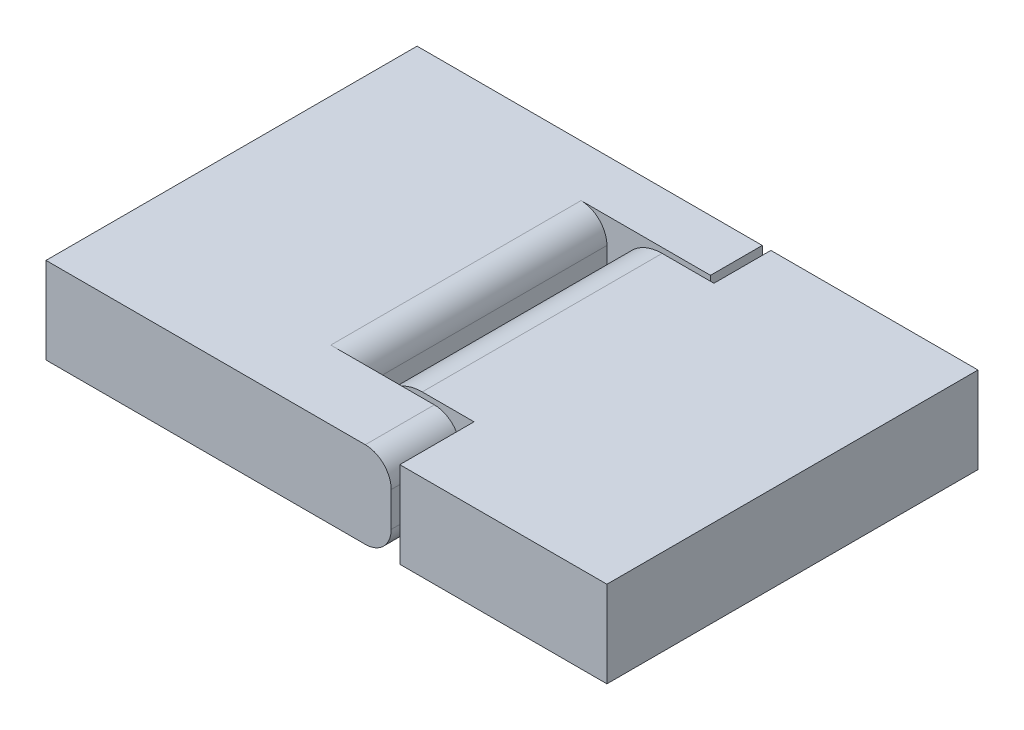
ISO-10303-21;
HEADER;
FILE_DESCRIPTION(('STEP AP214'),'2;1');
FILE_NAME('part.step','',(''),(''),'','','');
FILE_SCHEMA(('AUTOMOTIVE_DESIGN { 1 0 10303 214 1 1 1 1 }'));
ENDSEC;
DATA;
#1=APPLICATION_CONTEXT('core data for automotive mechanical design processes');
#2=APPLICATION_PROTOCOL_DEFINITION('international standard','automotive_design',2000,#1);
#3=PRODUCT_CONTEXT('',#1,'mechanical');
#4=PRODUCT('Part','Part','',(#3));
#5=PRODUCT_RELATED_PRODUCT_CATEGORY('part','',(#4));
#6=PRODUCT_DEFINITION_FORMATION('','',#4);
#7=PRODUCT_DEFINITION_CONTEXT('part definition',#1,'design');
#8=PRODUCT_DEFINITION('design','',#6,#7);
#9=PRODUCT_DEFINITION_SHAPE('','',#8);
#10=(LENGTH_UNIT() NAMED_UNIT(*) SI_UNIT(.MILLI.,.METRE.));
#11=(NAMED_UNIT(*) PLANE_ANGLE_UNIT() SI_UNIT($,.RADIAN.));
#12=(NAMED_UNIT(*) SI_UNIT($,.STERADIAN.) SOLID_ANGLE_UNIT());
#13=UNCERTAINTY_MEASURE_WITH_UNIT(LENGTH_MEASURE(1.E-05),#10,'distance_accuracy_value','');
#14=(GEOMETRIC_REPRESENTATION_CONTEXT(3) GLOBAL_UNCERTAINTY_ASSIGNED_CONTEXT((#13)) GLOBAL_UNIT_ASSIGNED_CONTEXT((#10,
#11,#12)) REPRESENTATION_CONTEXT('',''));
#15=CARTESIAN_POINT('',(0.,0.,0.));
#16=DIRECTION('',(0.,0.,1.));
#17=DIRECTION('',(1.,0.,0.));
#18=AXIS2_PLACEMENT_3D('',#15,#16,#17);
#19=CARTESIAN_POINT('',(14.,-67.5,3.));
#20=DIRECTION('',(-1.,0.,0.));
#21=DIRECTION('',(0.,0.,1.));
#22=AXIS2_PLACEMENT_3D('',#19,#20,#21);
#23=PLANE('',#22);
#24=DIRECTION('',(0.,1.,0.));
#25=VECTOR('',#24,1.);
#26=CARTESIAN_POINT('',(14.,-67.5,3.));
#27=LINE('',#26,#25);
#28=CARTESIAN_POINT('',(14.,-1.,3.));
#29=VERTEX_POINT('',#28);
#30=CARTESIAN_POINT('',(14.,1.,3.));
#31=VERTEX_POINT('',#30);
#32=EDGE_CURVE('E211',#29,#31,#27,.T.);
#33=ORIENTED_EDGE('',*,*,#32,.T.);
#34=DIRECTION('',(0.,0.,1.));
#35=VECTOR('',#34,1.);
#36=CARTESIAN_POINT('',(14.,1.,3.));
#37=LINE('',#36,#35);
#38=CARTESIAN_POINT('',(14.,1.,17.5));
#39=VERTEX_POINT('',#38);
#40=EDGE_CURVE('E214',#31,#39,#37,.T.);
#41=ORIENTED_EDGE('',*,*,#40,.T.);
#42=DIRECTION('',(0.,1.,0.));
#43=VECTOR('',#42,1.);
#44=CARTESIAN_POINT('',(14.,-67.5,17.5));
#45=LINE('',#44,#43);
#46=CARTESIAN_POINT('',(14.,-1.,17.5));
#47=VERTEX_POINT('',#46);
#48=EDGE_CURVE('E215',#47,#39,#45,.T.);
#49=ORIENTED_EDGE('',*,*,#48,.F.);
#50=DIRECTION('',(0.,0.,-1.));
#51=VECTOR('',#50,1.);
#52=CARTESIAN_POINT('',(14.,-1.,3.));
#53=LINE('',#52,#51);
#54=EDGE_CURVE('E352',#47,#29,#53,.T.);
#55=ORIENTED_EDGE('',*,*,#54,.T.);
#56=EDGE_LOOP('',(#33,#41,#49,#55));
#57=FACE_BOUND('',#56,.T.);
#58=ADVANCED_FACE('F52',(#57),#23,.F.);
#59=CARTESIAN_POINT('',(17.5,0.,73.5355339059328));
#60=DIRECTION('',(0.,0.,-1.));
#61=DIRECTION('',(-1.,0.,0.));
#62=AXIS2_PLACEMENT_3D('',#59,#60,#61);
#63=CYLINDRICAL_SURFACE('',#62,1.25);
#64=CARTESIAN_POINT('',(17.5,0.,3.));
#65=DIRECTION('',(0.,0.,-1.));
#66=DIRECTION('',(-1.,0.,0.));
#67=AXIS2_PLACEMENT_3D('',#64,#65,#66);
#68=CIRCLE('',#67,1.25);
#69=CARTESIAN_POINT('',(16.75,-1.,3.));
#70=VERTEX_POINT('',#69);
#71=CARTESIAN_POINT('',(18.25,-1.,3.));
#72=VERTEX_POINT('',#71);
#73=EDGE_CURVE('E195',#70,#72,#68,.F.);
#74=ORIENTED_EDGE('',*,*,#73,.T.);
#75=EDGE_CURVE('E230',#72,#70,#68,.F.);
#76=ORIENTED_EDGE('',*,*,#75,.T.);
#77=EDGE_LOOP('',(#74,#76));
#78=FACE_BOUND('',#77,.T.);
#79=CARTESIAN_POINT('',(17.5,0.,17.5));
#80=DIRECTION('',(0.,0.,1.));
#81=DIRECTION('',(1.,0.,0.));
#82=AXIS2_PLACEMENT_3D('',#79,#80,#81);
#83=CIRCLE('',#82,1.25);
#84=CARTESIAN_POINT('',(18.75,0.,17.5));
#85=VERTEX_POINT('',#84);
#86=EDGE_CURVE('E226',#85,#85,#83,.F.);
#87=ORIENTED_EDGE('',*,*,#86,.T.);
#88=EDGE_LOOP('',(#87));
#89=FACE_BOUND('',#88,.T.);
#90=ADVANCED_FACE('F302',(#78,#89),#63,.T.);
#91=CARTESIAN_POINT('',(12.5,-1.,3.));
#92=DIRECTION('',(0.,0.,1.));
#93=DIRECTION('',(1.,0.,0.));
#94=AXIS2_PLACEMENT_3D('',#91,#92,#93);
#95=CYLINDRICAL_SURFACE('',#94,1.5);
#96=CARTESIAN_POINT('',(12.5,-1.,17.5));
#97=DIRECTION('',(0.,0.,1.));
#98=DIRECTION('',(1.,0.,0.));
#99=AXIS2_PLACEMENT_3D('',#96,#97,#98);
#100=CIRCLE('',#99,1.5);
#101=CARTESIAN_POINT('',(12.5,-2.5,17.5));
#102=VERTEX_POINT('',#101);
#103=EDGE_CURVE('E208',#102,#47,#100,.T.);
#104=ORIENTED_EDGE('',*,*,#103,.F.);
#105=DIRECTION('',(0.,0.,-1.));
#106=VECTOR('',#105,1.);
#107=CARTESIAN_POINT('',(12.5,-2.5,17.5));
#108=LINE('',#107,#106);
#109=CARTESIAN_POINT('',(12.5,-2.5,1.5));
#110=VERTEX_POINT('',#109);
#111=EDGE_CURVE('E345',#110,#102,#108,.F.);
#112=ORIENTED_EDGE('',*,*,#111,.F.);
#113=CARTESIAN_POINT('',(12.5,-1.,1.5));
#114=DIRECTION('',(-0.707106781186547,0.,0.707106781186547));
#115=DIRECTION('',(-0.707106781186548,0.,-0.707106781186547));
#116=AXIS2_PLACEMENT_3D('',#113,#114,#115);
#117=ELLIPSE('',#116,2.12132034355964,1.5);
#118=EDGE_CURVE('E229',#29,#110,#117,.F.);
#119=ORIENTED_EDGE('',*,*,#118,.F.);
#120=ORIENTED_EDGE('',*,*,#54,.F.);
#121=EDGE_LOOP('',(#104,#112,#119,#120));
#122=FACE_BOUND('',#121,.T.);
#123=ADVANCED_FACE('F298',(#122),#95,.T.);
#124=CARTESIAN_POINT('',(20.,-1.,1.5));
#125=DIRECTION('',(-1.,0.,0.));
#126=DIRECTION('',(0.,-1.,0.));
#127=AXIS2_PLACEMENT_3D('',#124,#125,#126);
#128=CYLINDRICAL_SURFACE('',#127,1.5);
#129=ORIENTED_EDGE('',*,*,#118,.T.);
#130=DIRECTION('',(1.,0.,0.));
#131=VECTOR('',#130,1.);
#132=CARTESIAN_POINT('',(14.,-2.5,1.5));
#133=LINE('',#132,#131);
#134=CARTESIAN_POINT('',(16.75,-2.5,1.5));
#135=VERTEX_POINT('',#134);
#136=EDGE_CURVE('E255',#135,#110,#133,.F.);
#137=ORIENTED_EDGE('',*,*,#136,.F.);
#138=CARTESIAN_POINT('',(16.75,-1.,1.5));
#139=DIRECTION('',(1.,0.,0.));
#140=DIRECTION('',(0.,0.,-1.));
#141=AXIS2_PLACEMENT_3D('',#138,#139,#140);
#142=CIRCLE('',#141,1.5);
#143=EDGE_CURVE('E364',#70,#135,#142,.T.);
#144=ORIENTED_EDGE('',*,*,#143,.F.);
#145=DIRECTION('',(1.,0.,0.));
#146=VECTOR('',#145,1.);
#147=CARTESIAN_POINT('',(20.,-1.,3.));
#148=LINE('',#147,#146);
#149=EDGE_CURVE('E366',#29,#70,#148,.T.);
#150=ORIENTED_EDGE('',*,*,#149,.F.);
#151=EDGE_LOOP('',(#129,#137,#144,#150));
#152=FACE_BOUND('',#151,.T.);
#153=ADVANCED_FACE('F275',(#152),#128,.T.);
#154=CARTESIAN_POINT('',(18.5254373754571,-0.714827384069442,3.));
#155=CARTESIAN_POINT('',(18.4294069075514,-2.5,3.33208708206568));
#156=CARTESIAN_POINT('',(18.9345244883139,-2.5,1.58531829968088));
#157=CARTESIAN_POINT('',(18.5181538577066,-0.725268670146153,3.));
#158=CARTESIAN_POINT('',(18.4320571705259,-2.5,3.31924517506521));
#159=CARTESIAN_POINT('',(18.9033836072926,-2.5,1.57631168888648));
#160=CARTESIAN_POINT('',(18.5103468547867,-0.736136165532804,3.));
#161=CARTESIAN_POINT('',(18.4334338076438,-2.5,3.30565103714281));
#162=CARTESIAN_POINT('',(18.8720165255416,-2.5,1.56811684274254));
#163=CARTESIAN_POINT('',(18.4934891925596,-0.758735432311158,3.));
#164=CARTESIAN_POINT('',(18.4333103065964,-2.5,3.27729896772293));
#165=CARTESIAN_POINT('',(18.8089308555024,-2.5,1.55327836669485));
#166=CARTESIAN_POINT('',(18.4844390628839,-0.770466834655068,3.));
#167=CARTESIAN_POINT('',(18.4318372248216,-2.5,3.26256012677859));
#168=CARTESIAN_POINT('',(18.7772124221696,-2.5,1.54663407941533));
#169=CARTESIAN_POINT('',(18.4552026250591,-0.806884822451962,3.));
#170=CARTESIAN_POINT('',(18.4228191738973,-2.5,3.21731353714972));
#171=CARTESIAN_POINT('',(18.6819126189849,-2.5,1.52895861055432));
#172=CARTESIAN_POINT('',(18.4328716135375,-0.832883828050284,3.));
#173=CARTESIAN_POINT('',(18.4108017012481,-2.5,3.18533625493745));
#174=CARTESIAN_POINT('',(18.6179201407846,-2.5,1.52010949090784));
#175=CARTESIAN_POINT('',(18.3805600841235,-0.888007067803696,3.));
#176=CARTESIAN_POINT('',(18.3728438339122,-2.5,3.12023947876433));
#177=CARTESIAN_POINT('',(18.4896297250528,-2.5,1.50741803392438));
#178=CARTESIAN_POINT('',(18.350597517836,-0.917123876090051,3.));
#179=CARTESIAN_POINT('',(18.3472446395868,-2.5,3.08720307088221));
#180=CARTESIAN_POINT('',(18.4253328471972,-2.5,1.50356407432842));
#181=CARTESIAN_POINT('',(18.2805330655034,-0.977450753954424,3.));
#182=CARTESIAN_POINT('',(18.2812675792972,-2.5,3.02261752335643));
#183=CARTESIAN_POINT('',(18.2965635329503,-2.5,1.49966315134798));
#184=CARTESIAN_POINT('',(18.2404181086497,-1.00866348359854,3.));
#185=CARTESIAN_POINT('',(18.2411957307359,-2.5,2.99106212069215));
#186=CARTESIAN_POINT('',(18.2320909770466,-2.5,1.49962112093503));
#187=CARTESIAN_POINT('',(18.1618153476843,-1.06112830726935,3.));
#188=CARTESIAN_POINT('',(18.1606839125924,-2.5,2.94117178358288));
#189=CARTESIAN_POINT('',(18.1227739240634,-2.5,1.50154558184225));
#190=CARTESIAN_POINT('',(18.1265315780857,-1.08252727338785,3.));
#191=CARTESIAN_POINT('',(18.1243202585212,-2.5,2.9217893739604));
#192=CARTESIAN_POINT('',(18.0779134244404,-2.5,1.50290611434028));
#193=CARTESIAN_POINT('',(18.0494735032924,-1.12360328676496,3.));
#194=CARTESIAN_POINT('',(18.0451276099636,-2.5,2.88614662119471));
#195=CARTESIAN_POINT('',(17.9882112219135,-2.5,1.50620163046961));
#196=CARTESIAN_POINT('',(18.0076987146165,-1.14328020558669,3.));
#197=CARTESIAN_POINT('',(18.0023280122096,-2.5,2.86982362105171));
#198=CARTESIAN_POINT('',(17.9433695206594,-2.5,1.50813665690167));
#199=CARTESIAN_POINT('',(17.9178776278791,-1.17906956430334,3.));
#200=CARTESIAN_POINT('',(17.9112737215523,-2.5,2.84121035227284));
#201=CARTESIAN_POINT('',(17.8537337871714,-2.5,1.512000040097));
#202=CARTESIAN_POINT('',(17.8698380233965,-1.1951857597948,3.));
#203=CARTESIAN_POINT('',(17.8629799388569,-2.5,2.82884055425752));
#204=CARTESIAN_POINT('',(17.8089397547838,-2.5,1.51392840175546));
#205=CARTESIAN_POINT('',(17.7686070937925,-1.22191743071577,3.));
#206=CARTESIAN_POINT('',(17.7624105801602,-2.5,2.80885350820204));
#207=CARTESIAN_POINT('',(17.7193331959001,-2.5,1.51725246899945));
#208=CARTESIAN_POINT('',(17.7154161446508,-1.2325333072369,3.));
#209=CARTESIAN_POINT('',(17.7100009975217,-2.5,2.8011661595415));
#210=CARTESIAN_POINT('',(17.674520670991,-2.5,1.51864821342228));
#211=CARTESIAN_POINT('',(17.6059805710363,-1.2467214472408,3.));
#212=CARTESIAN_POINT('',(17.6030558985246,-2.5,2.79101230096917));
#213=CARTESIAN_POINT('',(17.5847481296508,-2.5,1.52053179803238));
#214=CARTESIAN_POINT('',(17.5497277485016,-1.25027373830659,3.));
#215=CARTESIAN_POINT('',(17.5483035050995,-2.5,2.78851837567441));
#216=CARTESIAN_POINT('',(17.5397880540319,-2.5,1.52101706360637));
#217=CARTESIAN_POINT('',(17.4373433373134,-1.24969283010621,3.));
#218=CARTESIAN_POINT('',(17.4391278762014,-2.5,2.78892810382156));
#219=CARTESIAN_POINT('',(17.4498686762802,-2.5,1.52093852408599));
#220=CARTESIAN_POINT('',(17.3812117492662,-1.24555959249188,3.));
#221=CARTESIAN_POINT('',(17.3844650458987,-2.5,2.79183358071364));
#222=CARTESIAN_POINT('',(17.4049093741525,-2.5,1.52037471375709));
#223=CARTESIAN_POINT('',(17.2719857738376,-1.23026917216348,3.));
#224=CARTESIAN_POINT('',(17.2776218599235,-2.5,2.80280250832105));
#225=CARTESIAN_POINT('',(17.3149400050718,-2.5,1.51835114886176));
#226=CARTESIAN_POINT('',(17.2188964552567,-1.21910061884065,3.));
#227=CARTESIAN_POINT('',(17.2252387483633,-2.5,2.81091958228353));
#228=CARTESIAN_POINT('',(17.2699299739071,-2.5,1.51688994400544));
#229=CARTESIAN_POINT('',(17.1180530927094,-1.19136906550995,3.));
#230=CARTESIAN_POINT('',(17.1248919753709,-2.5,2.831751733265));
#231=CARTESIAN_POINT('',(17.1799279053283,-2.5,1.51346927857161));
#232=CARTESIAN_POINT('',(17.0702993796305,-1.17480573119401,3.));
#233=CARTESIAN_POINT('',(17.0767997303179,-2.5,2.84453910717363));
#234=CARTESIAN_POINT('',(17.1349358692024,-2.5,1.51150978711754));
#235=CARTESIAN_POINT('',(16.9806982267485,-1.13807016548292,3.));
#236=CARTESIAN_POINT('',(16.9858176726118,-2.5,2.87410367451132));
#237=CARTESIAN_POINT('',(17.0444387973175,-2.5,1.50761315473926));
#238=CARTESIAN_POINT('',(16.9389240116442,-1.11785908984336,3.));
#239=CARTESIAN_POINT('',(16.9429591423762,-2.5,2.89100079602459));
#240=CARTESIAN_POINT('',(16.9989337376723,-2.5,1.50567652027148));
#241=CARTESIAN_POINT('',(16.8620375883993,-1.07583799842909,3.));
#242=CARTESIAN_POINT('',(16.8639034630228,-2.5,2.92778501834361));
#243=CARTESIAN_POINT('',(16.9078994742226,-2.5,1.50245572866716));
#244=CARTESIAN_POINT('',(16.826925111871,-1.0540280471189,3.));
#245=CARTESIAN_POINT('',(16.8277440627198,-2.5,2.94773551942713));
#246=CARTESIAN_POINT('',(16.8623702714649,-2.5,1.50117154524122));
#247=CARTESIAN_POINT('',(16.7629230403541,-1.01030520369425,3.));
#248=CARTESIAN_POINT('',(16.7625616821615,-2.5,2.98960177945856));
#249=CARTESIAN_POINT('',(16.7714241043641,-2.5,1.49984029687464));
#250=CARTESIAN_POINT('',(16.7340152618452,-0.988392810133726,3.));
#251=CARTESIAN_POINT('',(16.73360386437,-2.5,3.01155049047351));
#252=CARTESIAN_POINT('',(16.7260072085785,-2.5,1.49978956671262));
#253=CARTESIAN_POINT('',(16.6814876045713,-0.945351959387031,3.));
#254=CARTESIAN_POINT('',(16.6827520389893,-2.5,3.05650316206636));
#255=CARTESIAN_POINT('',(16.6352065784992,-2.5,1.50143352589001));
#256=CARTESIAN_POINT('',(16.6578668257731,-0.924223369281629,3.));
#257=CARTESIAN_POINT('',(16.6609671274352,-2.5,3.07951808211798));
#258=CARTESIAN_POINT('',(16.5898228398742,-2.5,1.50312791787272));
#259=CARTESIAN_POINT('',(16.6150695134176,-0.883330533934682,3.));
#260=CARTESIAN_POINT('',(16.6243061896305,-2.5,3.12564434530362));
#261=CARTESIAN_POINT('',(16.4992370124762,-2.5,1.50870308770633));
#262=CARTESIAN_POINT('',(16.595887746528,-0.863564701592604,3.));
#263=CARTESIAN_POINT('',(16.609534984923,-2.5,3.14874297415023));
#264=CARTESIAN_POINT('',(16.4540347721761,-2.5,1.51258127227539));
#265=CARTESIAN_POINT('',(16.561142801525,-0.825655118386485,3.));
#266=CARTESIAN_POINT('',(16.5865176457301,-2.5,3.19417391248027));
#267=CARTESIAN_POINT('',(16.3639289643466,-2.5,1.52288682933896));
#268=CARTESIAN_POINT('',(16.5455785875141,-0.807510904085311,3.));
#269=CARTESIAN_POINT('',(16.5783733040328,-2.5,3.21647488739317));
#270=CARTESIAN_POINT('',(16.3190253149015,-2.5,1.52931347064499));
#271=CARTESIAN_POINT('',(16.5172034542241,-0.772738043269527,3.));
#272=CARTESIAN_POINT('',(16.568048675711,-2.5,3.25974588017217));
#273=CARTESIAN_POINT('',(16.2291864357231,-2.5,1.5451051227606));
#274=CARTESIAN_POINT('',(16.5044269127736,-0.756129633630194,3.));
#275=CARTESIAN_POINT('',(16.5660300583776,-2.5,3.2806478096654));
#276=CARTESIAN_POINT('',(16.1842569943812,-2.5,1.55450366288152));
#277=CARTESIAN_POINT('',(16.4812825439528,-0.724624757680164,3.));
#278=CARTESIAN_POINT('',(16.5675319988595,-2.5,3.32012333518297));
#279=CARTESIAN_POINT('',(16.0951155281089,-2.5,1.57644210764777));
#280=CARTESIAN_POINT('',(16.4709177434204,-0.709730454362569,3.));
#281=CARTESIAN_POINT('',(16.5711299774782,-2.5,3.33864021757338));
#282=CARTESIAN_POINT('',(16.0509044687854,-2.5,1.58898591918054));
#283=CARTESIAN_POINT('',(16.4614844478706,-0.695690626633311,3.));
#284=CARTESIAN_POINT('',(16.5770979832501,-2.5,3.35549147178759));
#285=CARTESIAN_POINT('',(16.007216414534,-2.5,1.60320496880552));
#286=(BOUNDED_SURFACE() B_SPLINE_SURFACE(3,2,((#154,#155,#156),(#157,#158,#159),(#160,#161,
#162),(#163,#164,#165),(#166,#167,#168),(#169,#170,#171),(#172,#173,#174),(#175,#176,#177),
(#178,#179,#180),(#181,#182,#183),(#184,#185,#186),(#187,#188,#189),(#190,#191,#192),(#193,#194,
#195),(#196,#197,#198),(#199,#200,#201),(#202,#203,#204),(#205,#206,#207),(#208,#209,#210),
(#211,#212,#213),(#214,#215,#216),(#217,#218,#219),(#220,#221,#222),(#223,#224,#225),(#226,#227,
#228),(#229,#230,#231),(#232,#233,#234),(#235,#236,#237),(#238,#239,#240),(#241,#242,#243),
(#244,#245,#246),(#247,#248,#249),(#250,#251,#252),(#253,#254,#255),(#256,#257,#258),(#259,#260,
#261),(#262,#263,#264),(#265,#266,#267),(#268,#269,#270),(#271,#272,#273),(#274,#275,#276),
(#277,#278,#279),(#280,#281,#282),(#283,#284,#285)),.UNSPECIFIED.,.F.,.F.,
.F.) B_SPLINE_SURFACE_WITH_KNOTS((4,2,2,2,2,2,2,2,2,2,2,2,2,2,2,2,2,2,2,2,2,4),(3,3),(0.,
0.0972268950948821,0.194412494632377,0.387955992667594,0.581048359064524,0.774390600400879,
0.909029682349621,1.0436787976534,1.17818520943958,1.31268181143263,1.44755816731119,
1.58243519617847,1.7175307771042,1.8526347313332,1.98927282558929,2.12590541380879,
2.26213194684992,2.39833527167557,2.53437719336785,2.67038011090677,2.80797573246547,
2.94574312202627),(0.,1.),
.UNSPECIFIED.) GEOMETRIC_REPRESENTATION_ITEM() RATIONAL_B_SPLINE_SURFACE(((1.,0.636350894834352,
1.),(1.,0.639085482206067,1.),(1.,0.641914231540437,1.),(1.,0.647755389666036,1.),(1.,
0.650767719940565,1.),(1.,0.660050269167321,1.),(1.,0.666589391804221,1.),(1.,0.680231778563735,
1.),(1.,0.687333692197911,1.),(1.,0.701808639744511,1.),(1.,0.709182012612438,1.),(1.,
0.721388622848598,1.),(1.,0.726313375117133,1.),(1.,0.735678544634821,1.),(1.,0.740118925763798,
1.),(1.,0.748135033189936,1.),(1.,0.751711670876108,1.),(1.,0.757615594379645,1.),(1.,
0.759942971295451,1.),(1.,0.763048548946118,1.),(1.,0.76382235699612,1.),(1.,0.763695579266297,
1.),(1.,0.762794985131778,1.),(1.,0.759446512074815,1.),(1.,0.756996128327464,1.),(1.,
0.750865422415274,1.),(1.,0.747185024027544,1.),(1.,0.738945498830948,1.),(1.,0.734376868393005,
1.),(1.,0.724777473059719,1.),(1.,0.719746726794196,1.),(1.,0.709549895215813,1.),(1.,
0.704384256545691,1.),(1.,0.694125609820645,1.),(1.,0.689032589541943,1.),(1.,0.679069234898201,
1.),(1.,0.674198643798708,1.),(1.,0.664761106643718,1.),(1.,0.660194073931469,1.),(1.,
0.651356904384357,1.),(1.,0.647090870776682,1.),(1.,0.638924782603754,1.),(1.,0.63502519155792,
1.),(1.,0.631318891061485,1.))) REPRESENTATION_ITEM('') SURFACE());
#287=ORIENTED_EDGE('',*,*,#143,.T.);
#288=CARTESIAN_POINT('',(18.9345244883139,-2.5,1.58531829968088));
#289=CARTESIAN_POINT('',(18.9033836072926,-2.5,1.57631168888648));
#290=CARTESIAN_POINT('',(18.8720165255416,-2.5,1.56811684274254));
#291=CARTESIAN_POINT('',(18.8089308555024,-2.5,1.55327836669485));
#292=CARTESIAN_POINT('',(18.7772124221696,-2.5,1.54663407941533));
#293=CARTESIAN_POINT('',(18.6819126189849,-2.5,1.52895861055432));
#294=CARTESIAN_POINT('',(18.6179201407846,-2.5,1.52010949090784));
#295=CARTESIAN_POINT('',(18.4896297250528,-2.5,1.50741803392438));
#296=CARTESIAN_POINT('',(18.4253328471972,-2.5,1.50356407432842));
#297=CARTESIAN_POINT('',(18.2965635329503,-2.5,1.49966315134798));
#298=CARTESIAN_POINT('',(18.2320909770466,-2.5,1.49962112093503));
#299=CARTESIAN_POINT('',(18.1227739240634,-2.5,1.50154558184225));
#300=CARTESIAN_POINT('',(18.0779134244404,-2.5,1.50290611434028));
#301=CARTESIAN_POINT('',(17.9882112219135,-2.5,1.50620163046961));
#302=CARTESIAN_POINT('',(17.9433695206594,-2.5,1.50813665690167));
#303=CARTESIAN_POINT('',(17.8537337871714,-2.5,1.512000040097));
#304=CARTESIAN_POINT('',(17.8089397547838,-2.5,1.51392840175546));
#305=CARTESIAN_POINT('',(17.7193331959001,-2.5,1.51725246899945));
#306=CARTESIAN_POINT('',(17.674520670991,-2.5,1.51864821342228));
#307=CARTESIAN_POINT('',(17.5847481296508,-2.5,1.52053179803238));
#308=CARTESIAN_POINT('',(17.5397880540319,-2.5,1.52101706360637));
#309=CARTESIAN_POINT('',(17.4498686762802,-2.5,1.52093852408599));
#310=CARTESIAN_POINT('',(17.4049093741525,-2.5,1.52037471375709));
#311=CARTESIAN_POINT('',(17.3149400050718,-2.5,1.51835114886176));
#312=CARTESIAN_POINT('',(17.2699299739071,-2.5,1.51688994400544));
#313=CARTESIAN_POINT('',(17.1799279053283,-2.5,1.51346927857161));
#314=CARTESIAN_POINT('',(17.1349358692024,-2.5,1.51150978711754));
#315=CARTESIAN_POINT('',(17.0444387973175,-2.5,1.50761315473926));
#316=CARTESIAN_POINT('',(16.9989337376723,-2.5,1.50567652027148));
#317=CARTESIAN_POINT('',(16.9078994742226,-2.5,1.50245572866716));
#318=CARTESIAN_POINT('',(16.8623702714649,-2.5,1.50117154524122));
#319=CARTESIAN_POINT('',(16.7714241043641,-2.5,1.49984029687464));
#320=CARTESIAN_POINT('',(16.7260072085785,-2.5,1.49978956671262));
#321=CARTESIAN_POINT('',(16.6352065784992,-2.5,1.50143352589001));
#322=CARTESIAN_POINT('',(16.5898228398742,-2.5,1.50312791787272));
#323=CARTESIAN_POINT('',(16.4992370124762,-2.5,1.50870308770633));
#324=CARTESIAN_POINT('',(16.4540347721761,-2.5,1.51258127227539));
#325=CARTESIAN_POINT('',(16.3639289643466,-2.5,1.52288682933896));
#326=CARTESIAN_POINT('',(16.3190253149015,-2.5,1.52931347064499));
#327=CARTESIAN_POINT('',(16.2291864357231,-2.5,1.5451051227606));
#328=CARTESIAN_POINT('',(16.1842569943812,-2.5,1.55450366288152));
#329=CARTESIAN_POINT('',(16.0951155281089,-2.5,1.57644210764777));
#330=CARTESIAN_POINT('',(16.0509044687854,-2.5,1.58898591918054));
#331=CARTESIAN_POINT('',(16.007216414534,-2.5,1.60320496880552));
#332=B_SPLINE_CURVE_WITH_KNOTS('',3,(#288,#289,#290,#291,#292,#293,#294,#295,#296,#297,#298,
#299,#300,#301,#302,#303,#304,#305,#306,#307,#308,#309,#310,#311,#312,#313,#314,#315,#316,#317,
#318,#319,#320,#321,#322,#323,#324,#325,#326,#327,#328,#329,#330,#331),.UNSPECIFIED.,.F.,.F.,(4,
2,2,2,2,2,2,2,2,2,2,2,2,2,2,2,2,2,2,2,2,4),(0.,0.0972268950948821,0.194412494632377,
0.387955992667594,0.581048359064524,0.774390600400879,0.909029682349621,1.0436787976534,
1.17818520943958,1.31268181143263,1.44755816731119,1.58243519617847,1.7175307771042,
1.8526347313332,1.98927282558929,2.12590541380879,2.26213194684992,2.39833527167557,
2.53437719336785,2.67038011090677,2.80797573246547,2.94574312202627),.UNSPECIFIED.);
#333=CARTESIAN_POINT('',(18.25,-2.5,1.5));
#334=VERTEX_POINT('',#333);
#335=EDGE_CURVE('E247',#334,#135,#332,.T.);
#336=ORIENTED_EDGE('',*,*,#335,.F.);
#337=CARTESIAN_POINT('',(18.25,-1.,1.5));
#338=DIRECTION('',(1.,0.,0.));
#339=DIRECTION('',(0.,0.,-1.));
#340=AXIS2_PLACEMENT_3D('',#337,#338,#339);
#341=CIRCLE('',#340,1.5);
#342=EDGE_CURVE('E368',#72,#334,#341,.T.);
#343=ORIENTED_EDGE('',*,*,#342,.F.);
#344=ORIENTED_EDGE('',*,*,#73,.F.);
#345=EDGE_LOOP('',(#287,#336,#343,#344));
#346=FACE_BOUND('',#345,.T.);
#347=ADVANCED_FACE('F268',(#346),#286,.T.);
#348=CARTESIAN_POINT('',(20.,-1.,1.5));
#349=DIRECTION('',(-1.,0.,0.));
#350=DIRECTION('',(0.,-1.,0.));
#351=AXIS2_PLACEMENT_3D('',#348,#349,#350);
#352=CYLINDRICAL_SURFACE('',#351,1.5);
#353=ORIENTED_EDGE('',*,*,#342,.T.);
#354=DIRECTION('',(1.,0.,0.));
#355=VECTOR('',#354,1.);
#356=CARTESIAN_POINT('',(14.,-2.5,1.5));
#357=LINE('',#356,#355);
#358=CARTESIAN_POINT('',(18.5,-2.5,1.5));
#359=VERTEX_POINT('',#358);
#360=EDGE_CURVE('E189',#359,#334,#357,.F.);
#361=ORIENTED_EDGE('',*,*,#360,.F.);
#362=CARTESIAN_POINT('',(18.5,-1.,1.5));
#363=DIRECTION('',(-0.707106781186547,0.,0.707106781186547));
#364=DIRECTION('',(-0.707106781186548,0.,-0.707106781186547));
#365=AXIS2_PLACEMENT_3D('',#362,#363,#364);
#366=ELLIPSE('',#365,2.12132034355964,1.5);
#367=CARTESIAN_POINT('',(20.,-1.,3.));
#368=VERTEX_POINT('',#367);
#369=EDGE_CURVE('E374',#368,#359,#366,.F.);
#370=ORIENTED_EDGE('',*,*,#369,.F.);
#371=DIRECTION('',(1.,0.,0.));
#372=VECTOR('',#371,1.);
#373=CARTESIAN_POINT('',(20.,-1.,3.));
#374=LINE('',#373,#372);
#375=EDGE_CURVE('E166',#72,#368,#374,.T.);
#376=ORIENTED_EDGE('',*,*,#375,.F.);
#377=EDGE_LOOP('',(#353,#361,#370,#376));
#378=FACE_BOUND('',#377,.T.);
#379=ADVANCED_FACE('F274',(#378),#352,.T.);
#380=CARTESIAN_POINT('',(20.,-67.5,3.));
#381=DIRECTION('',(0.,0.,-1.));
#382=DIRECTION('',(-1.,0.,0.));
#383=AXIS2_PLACEMENT_3D('',#380,#381,#382);
#384=PLANE('',#383);
#385=ORIENTED_EDGE('',*,*,#32,.F.);
#386=ORIENTED_EDGE('',*,*,#149,.T.);
#387=ORIENTED_EDGE('',*,*,#75,.F.);
#388=ORIENTED_EDGE('',*,*,#375,.T.);
#389=DIRECTION('',(0.,1.,0.));
#390=VECTOR('',#389,1.);
#391=CARTESIAN_POINT('',(20.,-67.5,3.));
#392=LINE('',#391,#390);
#393=CARTESIAN_POINT('',(20.,2.5,3.));
#394=VERTEX_POINT('',#393);
#395=EDGE_CURVE('E159',#368,#394,#392,.T.);
#396=ORIENTED_EDGE('',*,*,#395,.T.);
#397=DIRECTION('',(-1.,0.,0.));
#398=VECTOR('',#397,1.);
#399=CARTESIAN_POINT('',(20.,2.5,3.));
#400=LINE('',#399,#398);
#401=CARTESIAN_POINT('',(12.5,2.5,3.));
#402=VERTEX_POINT('',#401);
#403=EDGE_CURVE('E163',#394,#402,#400,.T.);
#404=ORIENTED_EDGE('',*,*,#403,.T.);
#405=CARTESIAN_POINT('',(12.5,1.,3.));
#406=DIRECTION('',(0.,0.,-1.));
#407=DIRECTION('',(-1.,0.,0.));
#408=AXIS2_PLACEMENT_3D('',#405,#406,#407);
#409=CIRCLE('',#408,1.5);
#410=EDGE_CURVE('E181',#402,#31,#409,.T.);
#411=ORIENTED_EDGE('',*,*,#410,.T.);
#412=EDGE_LOOP('',(#385,#386,#387,#388,#396,#404,#411));
#413=FACE_BOUND('',#412,.T.);
#414=ADVANCED_FACE('F162',(#413),#384,.F.);
#415=CARTESIAN_POINT('',(12.5,1.,3.));
#416=DIRECTION('',(0.,0.,1.));
#417=DIRECTION('',(1.,0.,0.));
#418=AXIS2_PLACEMENT_3D('',#415,#416,#417);
#419=CYLINDRICAL_SURFACE('',#418,1.5);
#420=ORIENTED_EDGE('',*,*,#410,.F.);
#421=DIRECTION('',(0.,0.,1.));
#422=VECTOR('',#421,1.);
#423=CARTESIAN_POINT('',(12.5,2.5,70.));
#424=LINE('',#423,#422);
#425=CARTESIAN_POINT('',(12.5,2.5,17.5));
#426=VERTEX_POINT('',#425);
#427=EDGE_CURVE('E179',#426,#402,#424,.F.);
#428=ORIENTED_EDGE('',*,*,#427,.F.);
#429=CARTESIAN_POINT('',(12.5,1.,17.5));
#430=DIRECTION('',(0.,0.,1.));
#431=DIRECTION('',(1.,0.,0.));
#432=AXIS2_PLACEMENT_3D('',#429,#430,#431);
#433=CIRCLE('',#432,1.5);
#434=EDGE_CURVE('E206',#39,#426,#433,.T.);
#435=ORIENTED_EDGE('',*,*,#434,.F.);
#436=ORIENTED_EDGE('',*,*,#40,.F.);
#437=EDGE_LOOP('',(#420,#428,#435,#436));
#438=FACE_BOUND('',#437,.T.);
#439=ADVANCED_FACE('F391',(#438),#419,.T.);
#440=CARTESIAN_POINT('',(18.5,-1.,70.));
#441=DIRECTION('',(0.,0.,1.));
#442=DIRECTION('',(1.,0.,0.));
#443=AXIS2_PLACEMENT_3D('',#440,#441,#442);
#444=CYLINDRICAL_SURFACE('',#443,1.5);
#445=ORIENTED_EDGE('',*,*,#369,.T.);
#446=DIRECTION('',(0.,0.,-1.));
#447=VECTOR('',#446,1.);
#448=CARTESIAN_POINT('',(18.5,-2.5,3.));
#449=LINE('',#448,#447);
#450=CARTESIAN_POINT('',(18.5,-2.5,0.));
#451=VERTEX_POINT('',#450);
#452=EDGE_CURVE('E187',#451,#359,#449,.F.);
#453=ORIENTED_EDGE('',*,*,#452,.F.);
#454=CARTESIAN_POINT('',(18.5,-1.,0.));
#455=DIRECTION('',(0.,0.,1.));
#456=DIRECTION('',(1.,0.,0.));
#457=AXIS2_PLACEMENT_3D('',#454,#455,#456);
#458=CIRCLE('',#457,1.5);
#459=CARTESIAN_POINT('',(20.,-1.,0.));
#460=VERTEX_POINT('',#459);
#461=EDGE_CURVE('E199',#460,#451,#458,.F.);
#462=ORIENTED_EDGE('',*,*,#461,.F.);
#463=DIRECTION('',(0.,0.,-1.));
#464=VECTOR('',#463,1.);
#465=CARTESIAN_POINT('',(20.,-1.,0.));
#466=LINE('',#465,#464);
#467=EDGE_CURVE('E202',#368,#460,#466,.T.);
#468=ORIENTED_EDGE('',*,*,#467,.F.);
#469=EDGE_LOOP('',(#445,#453,#462,#468));
#470=FACE_BOUND('',#469,.T.);
#471=ADVANCED_FACE('F389',(#470),#444,.T.);
#472=CARTESIAN_POINT('',(20.,0.,70.));
#473=DIRECTION('',(-1.,0.,0.));
#474=DIRECTION('',(0.,0.,1.));
#475=AXIS2_PLACEMENT_3D('',#472,#473,#474);
#476=PLANE('',#475);
#477=ORIENTED_EDGE('',*,*,#395,.F.);
#478=ORIENTED_EDGE('',*,*,#467,.T.);
#479=DIRECTION('',(0.,1.,0.));
#480=VECTOR('',#479,1.);
#481=CARTESIAN_POINT('',(20.,0.,0.));
#482=LINE('',#481,#480);
#483=CARTESIAN_POINT('',(20.,2.5,0.));
#484=VERTEX_POINT('',#483);
#485=EDGE_CURVE('E186',#460,#484,#482,.T.);
#486=ORIENTED_EDGE('',*,*,#485,.T.);
#487=DIRECTION('',(0.,0.,-1.));
#488=VECTOR('',#487,1.);
#489=CARTESIAN_POINT('',(20.,2.5,70.));
#490=LINE('',#489,#488);
#491=EDGE_CURVE('E176',#394,#484,#490,.T.);
#492=ORIENTED_EDGE('',*,*,#491,.F.);
#493=EDGE_LOOP('',(#477,#478,#486,#492));
#494=FACE_BOUND('',#493,.T.);
#495=ADVANCED_FACE('F184',(#494),#476,.F.);
#496=CARTESIAN_POINT('',(14.,-67.5,17.5));
#497=DIRECTION('',(0.,0.,1.));
#498=DIRECTION('',(1.,0.,0.));
#499=AXIS2_PLACEMENT_3D('',#496,#497,#498);
#500=PLANE('',#499);
#501=ORIENTED_EDGE('',*,*,#86,.F.);
#502=EDGE_LOOP('',(#501));
#503=FACE_BOUND('',#502,.T.);
#504=DIRECTION('',(1.,0.,0.));
#505=VECTOR('',#504,1.);
#506=CARTESIAN_POINT('',(14.,2.5,17.5));
#507=LINE('',#506,#505);
#508=CARTESIAN_POINT('',(18.5,2.5,17.5));
#509=VERTEX_POINT('',#508);
#510=EDGE_CURVE('E201',#426,#509,#507,.T.);
#511=ORIENTED_EDGE('',*,*,#510,.T.);
#512=CARTESIAN_POINT('',(18.5,1.,17.5));
#513=DIRECTION('',(0.,0.,1.));
#514=DIRECTION('',(1.,0.,0.));
#515=AXIS2_PLACEMENT_3D('',#512,#513,#514);
#516=CIRCLE('',#515,1.5);
#517=CARTESIAN_POINT('',(20.,1.,17.5));
#518=VERTEX_POINT('',#517);
#519=EDGE_CURVE('E224',#509,#518,#516,.F.);
#520=ORIENTED_EDGE('',*,*,#519,.T.);
#521=DIRECTION('',(0.,1.,0.));
#522=VECTOR('',#521,1.);
#523=CARTESIAN_POINT('',(20.,-67.5,17.5));
#524=LINE('',#523,#522);
#525=CARTESIAN_POINT('',(20.,-1.,17.5));
#526=VERTEX_POINT('',#525);
#527=EDGE_CURVE('E218',#526,#518,#524,.T.);
#528=ORIENTED_EDGE('',*,*,#527,.F.);
#529=CARTESIAN_POINT('',(18.5,-1.,17.5));
#530=DIRECTION('',(0.,0.,1.));
#531=DIRECTION('',(1.,0.,0.));
#532=AXIS2_PLACEMENT_3D('',#529,#530,#531);
#533=CIRCLE('',#532,1.5);
#534=CARTESIAN_POINT('',(18.5,-2.5,17.5));
#535=VERTEX_POINT('',#534);
#536=EDGE_CURVE('E209',#526,#535,#533,.F.);
#537=ORIENTED_EDGE('',*,*,#536,.T.);
#538=DIRECTION('',(-1.,0.,0.));
#539=VECTOR('',#538,1.);
#540=CARTESIAN_POINT('',(0.,-2.5,17.5));
#541=LINE('',#540,#539);
#542=EDGE_CURVE('E207',#535,#102,#541,.T.);
#543=ORIENTED_EDGE('',*,*,#542,.T.);
#544=ORIENTED_EDGE('',*,*,#103,.T.);
#545=ORIENTED_EDGE('',*,*,#48,.T.);
#546=ORIENTED_EDGE('',*,*,#434,.T.);
#547=EDGE_LOOP('',(#511,#520,#528,#537,#543,#544,#545,#546));
#548=FACE_BOUND('',#547,.T.);
#549=ADVANCED_FACE('F314',(#503,#548),#500,.F.);
#550=CARTESIAN_POINT('',(18.5,-1.,70.));
#551=DIRECTION('',(0.,0.,1.));
#552=DIRECTION('',(1.,0.,0.));
#553=AXIS2_PLACEMENT_3D('',#550,#551,#552);
#554=CYLINDRICAL_SURFACE('',#553,1.5);
#555=CARTESIAN_POINT('',(18.5,-1.,21.5));
#556=DIRECTION('',(0.,0.,-1.));
#557=DIRECTION('',(-1.,0.,0.));
#558=AXIS2_PLACEMENT_3D('',#555,#556,#557);
#559=CIRCLE('',#558,1.5);
#560=CARTESIAN_POINT('',(18.5,-2.5,21.5));
#561=VERTEX_POINT('',#560);
#562=CARTESIAN_POINT('',(20.,-1.,21.5));
#563=VERTEX_POINT('',#562);
#564=EDGE_CURVE('E234',#561,#563,#559,.F.);
#565=ORIENTED_EDGE('',*,*,#564,.F.);
#566=DIRECTION('',(0.,0.,-1.));
#567=VECTOR('',#566,1.);
#568=CARTESIAN_POINT('',(18.5,-2.5,35.5));
#569=LINE('',#568,#567);
#570=EDGE_CURVE('E342',#535,#561,#569,.F.);
#571=ORIENTED_EDGE('',*,*,#570,.F.);
#572=ORIENTED_EDGE('',*,*,#536,.F.);
#573=DIRECTION('',(0.,0.,-1.));
#574=VECTOR('',#573,1.);
#575=CARTESIAN_POINT('',(20.,-1.,17.5));
#576=LINE('',#575,#574);
#577=EDGE_CURVE('E222',#563,#526,#576,.T.);
#578=ORIENTED_EDGE('',*,*,#577,.F.);
#579=EDGE_LOOP('',(#565,#571,#572,#578));
#580=FACE_BOUND('',#579,.T.);
#581=ADVANCED_FACE('F307',(#580),#554,.T.);
#582=CARTESIAN_POINT('',(18.5,1.,70.));
#583=DIRECTION('',(0.,0.,-1.));
#584=DIRECTION('',(-1.,0.,0.));
#585=AXIS2_PLACEMENT_3D('',#582,#583,#584);
#586=CYLINDRICAL_SURFACE('',#585,1.5);
#587=CARTESIAN_POINT('',(18.5,1.,21.5));
#588=DIRECTION('',(0.,0.,-1.));
#589=DIRECTION('',(-1.,0.,0.));
#590=AXIS2_PLACEMENT_3D('',#587,#588,#589);
#591=CIRCLE('',#590,1.5);
#592=CARTESIAN_POINT('',(20.,1.,21.5));
#593=VERTEX_POINT('',#592);
#594=CARTESIAN_POINT('',(18.5,2.5,21.5));
#595=VERTEX_POINT('',#594);
#596=EDGE_CURVE('E91',#593,#595,#591,.F.);
#597=ORIENTED_EDGE('',*,*,#596,.F.);
#598=DIRECTION('',(0.,0.,-1.));
#599=VECTOR('',#598,1.);
#600=CARTESIAN_POINT('',(20.,1.,70.));
#601=LINE('',#600,#599);
#602=EDGE_CURVE('E237',#518,#593,#601,.F.);
#603=ORIENTED_EDGE('',*,*,#602,.F.);
#604=ORIENTED_EDGE('',*,*,#519,.F.);
#605=DIRECTION('',(0.,0.,-1.));
#606=VECTOR('',#605,1.);
#607=CARTESIAN_POINT('',(18.5,2.5,70.));
#608=LINE('',#607,#606);
#609=EDGE_CURVE('E191',#595,#509,#608,.T.);
#610=ORIENTED_EDGE('',*,*,#609,.F.);
#611=EDGE_LOOP('',(#597,#603,#604,#610));
#612=FACE_BOUND('',#611,.T.);
#613=ADVANCED_FACE('F304',(#612),#586,.T.);
#614=CARTESIAN_POINT('',(0.,0.,0.));
#615=DIRECTION('',(0.,0.,1.));
#616=DIRECTION('',(1.,0.,0.));
#617=AXIS2_PLACEMENT_3D('',#614,#615,#616);
#618=PLANE('',#617);
#619=DIRECTION('',(-1.,0.,0.));
#620=VECTOR('',#619,1.);
#621=CARTESIAN_POINT('',(0.,-2.5,0.));
#622=LINE('',#621,#620);
#623=CARTESIAN_POINT('',(0.,-2.5,0.));
#624=VERTEX_POINT('',#623);
#625=EDGE_CURVE('E203',#451,#624,#622,.T.);
#626=ORIENTED_EDGE('',*,*,#625,.T.);
#627=DIRECTION('',(0.,1.,0.));
#628=VECTOR('',#627,1.);
#629=CARTESIAN_POINT('',(0.,-7.5,0.));
#630=LINE('',#629,#628);
#631=CARTESIAN_POINT('',(0.,2.5,0.));
#632=VERTEX_POINT('',#631);
#633=EDGE_CURVE('E69',#624,#632,#630,.T.);
#634=ORIENTED_EDGE('',*,*,#633,.T.);
#635=DIRECTION('',(-1.,0.,0.));
#636=VECTOR('',#635,1.);
#637=CARTESIAN_POINT('',(0.,2.5,0.));
#638=LINE('',#637,#636);
#639=EDGE_CURVE('E197',#484,#632,#638,.T.);
#640=ORIENTED_EDGE('',*,*,#639,.F.);
#641=ORIENTED_EDGE('',*,*,#485,.F.);
#642=ORIENTED_EDGE('',*,*,#461,.T.);
#643=EDGE_LOOP('',(#626,#634,#640,#641,#642));
#644=FACE_BOUND('',#643,.T.);
#645=ADVANCED_FACE('F306',(#644),#618,.F.);
#646=CARTESIAN_POINT('',(0.,2.5,70.));
#647=DIRECTION('',(0.,-1.,0.));
#648=DIRECTION('',(0.,0.,-1.));
#649=AXIS2_PLACEMENT_3D('',#646,#647,#648);
#650=PLANE('',#649);
#651=ORIENTED_EDGE('',*,*,#639,.T.);
#652=DIRECTION('',(0.,0.,-1.));
#653=VECTOR('',#652,1.);
#654=CARTESIAN_POINT('',(0.,2.5,0.));
#655=LINE('',#654,#653);
#656=CARTESIAN_POINT('',(0.,2.5,21.5));
#657=VERTEX_POINT('',#656);
#658=EDGE_CURVE('E12',#657,#632,#655,.T.);
#659=ORIENTED_EDGE('',*,*,#658,.F.);
#660=DIRECTION('',(-1.,0.,0.));
#661=VECTOR('',#660,1.);
#662=CARTESIAN_POINT('',(0.,2.5,21.5));
#663=LINE('',#662,#661);
#664=EDGE_CURVE('E56',#595,#657,#663,.T.);
#665=ORIENTED_EDGE('',*,*,#664,.F.);
#666=ORIENTED_EDGE('',*,*,#609,.T.);
#667=ORIENTED_EDGE('',*,*,#510,.F.);
#668=ORIENTED_EDGE('',*,*,#427,.T.);
#669=ORIENTED_EDGE('',*,*,#403,.F.);
#670=ORIENTED_EDGE('',*,*,#491,.T.);
#671=EDGE_LOOP('',(#651,#659,#665,#666,#667,#668,#669,#670));
#672=FACE_BOUND('',#671,.T.);
#673=ADVANCED_FACE('F175',(#672),#650,.F.);
#674=CARTESIAN_POINT('',(0.,-2.5,70.));
#675=DIRECTION('',(0.,-1.,0.));
#676=DIRECTION('',(1.,0.,0.));
#677=AXIS2_PLACEMENT_3D('',#674,#675,#676);
#678=PLANE('',#677);
#679=DIRECTION('',(0.,0.,1.));
#680=VECTOR('',#679,1.);
#681=CARTESIAN_POINT('',(0.,-2.5,70.));
#682=LINE('',#681,#680);
#683=CARTESIAN_POINT('',(0.,-2.5,21.5));
#684=VERTEX_POINT('',#683);
#685=EDGE_CURVE('E231',#624,#684,#682,.T.);
#686=ORIENTED_EDGE('',*,*,#685,.F.);
#687=ORIENTED_EDGE('',*,*,#625,.F.);
#688=ORIENTED_EDGE('',*,*,#452,.T.);
#689=ORIENTED_EDGE('',*,*,#360,.T.);
#690=ORIENTED_EDGE('',*,*,#335,.T.);
#691=ORIENTED_EDGE('',*,*,#136,.T.);
#692=ORIENTED_EDGE('',*,*,#111,.T.);
#693=ORIENTED_EDGE('',*,*,#542,.F.);
#694=ORIENTED_EDGE('',*,*,#570,.T.);
#695=DIRECTION('',(1.,0.,0.));
#696=VECTOR('',#695,1.);
#697=CARTESIAN_POINT('',(0.,-2.5,21.5));
#698=LINE('',#697,#696);
#699=EDGE_CURVE('E221',#684,#561,#698,.T.);
#700=ORIENTED_EDGE('',*,*,#699,.F.);
#701=EDGE_LOOP('',(#686,#687,#688,#689,#690,#691,#692,#693,#694,#700));
#702=FACE_BOUND('',#701,.T.);
#703=ADVANCED_FACE('F260',(#702),#678,.T.);
#704=ORIENTED_EDGE('',*,*,#602,.T.);
#705=DIRECTION('',(0.,-1.,0.));
#706=VECTOR('',#705,1.);
#707=CARTESIAN_POINT('',(20.,0.,21.5));
#708=LINE('',#707,#706);
#709=EDGE_CURVE('E95',#593,#563,#708,.T.);
#710=ORIENTED_EDGE('',*,*,#709,.T.);
#711=ORIENTED_EDGE('',*,*,#577,.T.);
#712=ORIENTED_EDGE('',*,*,#527,.T.);
#713=EDGE_LOOP('',(#704,#710,#711,#712));
#714=FACE_BOUND('',#713,.T.);
#715=ADVANCED_FACE('F264',(#714),#476,.F.);
#716=CARTESIAN_POINT('',(0.,-7.5,21.5));
#717=DIRECTION('',(0.,0.,-1.));
#718=DIRECTION('',(-1.,0.,0.));
#719=AXIS2_PLACEMENT_3D('',#716,#717,#718);
#720=PLANE('',#719);
#721=ORIENTED_EDGE('',*,*,#699,.T.);
#722=ORIENTED_EDGE('',*,*,#564,.T.);
#723=ORIENTED_EDGE('',*,*,#709,.F.);
#724=ORIENTED_EDGE('',*,*,#596,.T.);
#725=ORIENTED_EDGE('',*,*,#664,.T.);
#726=DIRECTION('',(0.,1.,0.));
#727=VECTOR('',#726,1.);
#728=CARTESIAN_POINT('',(0.,-7.5,21.5));
#729=LINE('',#728,#727);
#730=EDGE_CURVE('E62',#684,#657,#729,.T.);
#731=ORIENTED_EDGE('',*,*,#730,.F.);
#732=EDGE_LOOP('',(#721,#722,#723,#724,#725,#731));
#733=FACE_BOUND('',#732,.T.);
#734=ADVANCED_FACE('F328',(#733),#720,.F.);
#735=CARTESIAN_POINT('',(0.,-7.5,0.));
#736=DIRECTION('',(1.,0.,0.));
#737=DIRECTION('',(0.,0.,-1.));
#738=AXIS2_PLACEMENT_3D('',#735,#736,#737);
#739=PLANE('',#738);
#740=ORIENTED_EDGE('',*,*,#685,.T.);
#741=ORIENTED_EDGE('',*,*,#730,.T.);
#742=ORIENTED_EDGE('',*,*,#658,.T.);
#743=ORIENTED_EDGE('',*,*,#633,.F.);
#744=EDGE_LOOP('',(#740,#741,#742,#743));
#745=FACE_BOUND('',#744,.T.);
#746=ADVANCED_FACE('F54',(#745),#739,.F.);
#747=CLOSED_SHELL('',(#58,#90,#123,#153,#347,#379,#414,#439,#471,#495,#549,#581,#613,#645,#673,
#703,#715,#734,#746));
#748=MANIFOLD_SOLID_BREP('B2',#747);
#749=CARTESIAN_POINT('',(20.5,-56.0732209223974,0.));
#750=DIRECTION('',(-1.,0.,0.));
#751=DIRECTION('',(0.,0.,1.));
#752=AXIS2_PLACEMENT_3D('',#749,#750,#751);
#753=PLANE('',#752);
#754=DIRECTION('',(0.,-1.,0.));
#755=VECTOR('',#754,1.);
#756=CARTESIAN_POINT('',(20.5,-56.0732209223974,21.5));
#757=LINE('',#756,#755);
#758=CARTESIAN_POINT('',(20.5,2.5,21.5));
#759=VERTEX_POINT('',#758);
#760=CARTESIAN_POINT('',(20.5,-2.5,21.5));
#761=VERTEX_POINT('',#760);
#762=EDGE_CURVE('E612',#759,#761,#757,.T.);
#763=ORIENTED_EDGE('',*,*,#762,.F.);
#764=DIRECTION('',(0.,0.,1.));
#765=VECTOR('',#764,1.);
#766=CARTESIAN_POINT('',(20.5,2.5,0.));
#767=LINE('',#766,#765);
#768=CARTESIAN_POINT('',(20.5,2.5,17.2));
#769=VERTEX_POINT('',#768);
#770=EDGE_CURVE('E611',#769,#759,#767,.T.);
#771=ORIENTED_EDGE('',*,*,#770,.F.);
#772=DIRECTION('',(0.,-1.,0.));
#773=VECTOR('',#772,1.);
#774=CARTESIAN_POINT('',(20.5,0.,17.2));
#775=LINE('',#774,#773);
#776=CARTESIAN_POINT('',(20.5,-2.5,17.2));
#777=VERTEX_POINT('',#776);
#778=EDGE_CURVE('E631',#769,#777,#775,.T.);
#779=ORIENTED_EDGE('',*,*,#778,.T.);
#780=DIRECTION('',(0.,0.,1.));
#781=VECTOR('',#780,1.);
#782=CARTESIAN_POINT('',(20.5,-2.5,0.));
#783=LINE('',#782,#781);
#784=EDGE_CURVE('E632',#777,#761,#783,.T.);
#785=ORIENTED_EDGE('',*,*,#784,.T.);
#786=EDGE_LOOP('',(#763,#771,#779,#785));
#787=FACE_BOUND('',#786,.T.);
#788=ADVANCED_FACE('F536',(#787),#753,.T.);
#789=CARTESIAN_POINT('',(0.,2.5,17.2));
#790=DIRECTION('',(0.,1.,0.));
#791=DIRECTION('',(-1.,0.,0.));
#792=AXIS2_PLACEMENT_3D('',#789,#790,#791);
#793=PLANE('',#792);
#794=DIRECTION('',(0.,0.,1.));
#795=VECTOR('',#794,1.);
#796=CARTESIAN_POINT('',(32.5,2.5,3.85000000000001));
#797=LINE('',#796,#795);
#798=CARTESIAN_POINT('',(32.5,2.5,0.));
#799=VERTEX_POINT('',#798);
#800=CARTESIAN_POINT('',(32.5,2.5,21.5));
#801=VERTEX_POINT('',#800);
#802=EDGE_CURVE('E601',#799,#801,#797,.T.);
#803=ORIENTED_EDGE('',*,*,#802,.F.);
#804=DIRECTION('',(-1.,0.,0.));
#805=VECTOR('',#804,1.);
#806=CARTESIAN_POINT('',(20.5,2.5,0.));
#807=LINE('',#806,#805);
#808=CARTESIAN_POINT('',(20.5,2.5,0.));
#809=VERTEX_POINT('',#808);
#810=EDGE_CURVE('E606',#799,#809,#807,.T.);
#811=ORIENTED_EDGE('',*,*,#810,.T.);
#812=CARTESIAN_POINT('',(20.5,2.5,3.3));
#813=VERTEX_POINT('',#812);
#814=EDGE_CURVE('E625',#809,#813,#767,.T.);
#815=ORIENTED_EDGE('',*,*,#814,.T.);
#816=DIRECTION('',(1.,0.,0.));
#817=VECTOR('',#816,1.);
#818=CARTESIAN_POINT('',(0.,2.5,3.3));
#819=LINE('',#818,#817);
#820=CARTESIAN_POINT('',(17.5,2.5,3.3));
#821=VERTEX_POINT('',#820);
#822=EDGE_CURVE('E652',#821,#813,#819,.T.);
#823=ORIENTED_EDGE('',*,*,#822,.F.);
#824=DIRECTION('',(0.,0.,-1.));
#825=VECTOR('',#824,1.);
#826=CARTESIAN_POINT('',(17.5,2.5,17.2));
#827=LINE('',#826,#825);
#828=CARTESIAN_POINT('',(17.5,2.5,17.2));
#829=VERTEX_POINT('',#828);
#830=EDGE_CURVE('E661',#829,#821,#827,.T.);
#831=ORIENTED_EDGE('',*,*,#830,.F.);
#832=DIRECTION('',(1.,0.,0.));
#833=VECTOR('',#832,1.);
#834=CARTESIAN_POINT('',(0.,2.5,17.2));
#835=LINE('',#834,#833);
#836=EDGE_CURVE('E640',#829,#769,#835,.T.);
#837=ORIENTED_EDGE('',*,*,#836,.T.);
#838=ORIENTED_EDGE('',*,*,#770,.T.);
#839=DIRECTION('',(-1.,0.,0.));
#840=VECTOR('',#839,1.);
#841=CARTESIAN_POINT('',(0.,2.5,21.5));
#842=LINE('',#841,#840);
#843=EDGE_CURVE('E609',#801,#759,#842,.T.);
#844=ORIENTED_EDGE('',*,*,#843,.F.);
#845=EDGE_LOOP('',(#803,#811,#815,#823,#831,#837,#838,#844));
#846=FACE_BOUND('',#845,.T.);
#847=ADVANCED_FACE('F603',(#846),#793,.T.);
#848=CARTESIAN_POINT('',(17.5,0.,17.2));
#849=DIRECTION('',(0.,0.,-1.));
#850=DIRECTION('',(-1.,0.,0.));
#851=AXIS2_PLACEMENT_3D('',#848,#849,#850);
#852=CYLINDRICAL_SURFACE('',#851,2.5);
#853=CARTESIAN_POINT('',(17.5,0.,3.3));
#854=DIRECTION('',(0.,0.,1.));
#855=DIRECTION('',(1.,0.,0.));
#856=AXIS2_PLACEMENT_3D('',#853,#854,#855);
#857=CIRCLE('',#856,2.5);
#858=CARTESIAN_POINT('',(17.5,-2.5,3.3));
#859=VERTEX_POINT('',#858);
#860=EDGE_CURVE('E655',#821,#859,#857,.T.);
#861=ORIENTED_EDGE('',*,*,#860,.T.);
#862=DIRECTION('',(0.,0.,-1.));
#863=VECTOR('',#862,1.);
#864=CARTESIAN_POINT('',(17.5,-2.5,17.2));
#865=LINE('',#864,#863);
#866=CARTESIAN_POINT('',(17.5,-2.5,17.2));
#867=VERTEX_POINT('',#866);
#868=EDGE_CURVE('E649',#867,#859,#865,.T.);
#869=ORIENTED_EDGE('',*,*,#868,.F.);
#870=CARTESIAN_POINT('',(17.5,0.,17.2));
#871=DIRECTION('',(0.,0.,1.));
#872=DIRECTION('',(1.,0.,0.));
#873=AXIS2_PLACEMENT_3D('',#870,#871,#872);
#874=CIRCLE('',#873,2.5);
#875=EDGE_CURVE('E644',#829,#867,#874,.T.);
#876=ORIENTED_EDGE('',*,*,#875,.F.);
#877=ORIENTED_EDGE('',*,*,#830,.T.);
#878=EDGE_LOOP('',(#861,#869,#876,#877));
#879=FACE_BOUND('',#878,.T.);
#880=ADVANCED_FACE('F674',(#879),#852,.T.);
#881=CARTESIAN_POINT('',(0.,-2.5,17.2));
#882=DIRECTION('',(0.,-1.,0.));
#883=DIRECTION('',(1.,0.,0.));
#884=AXIS2_PLACEMENT_3D('',#881,#882,#883);
#885=PLANE('',#884);
#886=DIRECTION('',(-1.,0.,0.));
#887=VECTOR('',#886,1.);
#888=CARTESIAN_POINT('',(20.5,-2.5,0.));
#889=LINE('',#888,#887);
#890=CARTESIAN_POINT('',(32.5,-2.5,0.));
#891=VERTEX_POINT('',#890);
#892=CARTESIAN_POINT('',(20.5,-2.5,0.));
#893=VERTEX_POINT('',#892);
#894=EDGE_CURVE('E624',#891,#893,#889,.T.);
#895=ORIENTED_EDGE('',*,*,#894,.F.);
#896=DIRECTION('',(0.,0.,-1.));
#897=VECTOR('',#896,1.);
#898=CARTESIAN_POINT('',(32.5,-2.5,17.2));
#899=LINE('',#898,#897);
#900=CARTESIAN_POINT('',(32.5,-2.5,21.5));
#901=VERTEX_POINT('',#900);
#902=EDGE_CURVE('E50',#901,#891,#899,.T.);
#903=ORIENTED_EDGE('',*,*,#902,.F.);
#904=DIRECTION('',(1.,0.,0.));
#905=VECTOR('',#904,1.);
#906=CARTESIAN_POINT('',(0.,-2.5,21.5));
#907=LINE('',#906,#905);
#908=EDGE_CURVE('E551',#761,#901,#907,.T.);
#909=ORIENTED_EDGE('',*,*,#908,.F.);
#910=ORIENTED_EDGE('',*,*,#784,.F.);
#911=DIRECTION('',(-1.,0.,0.));
#912=VECTOR('',#911,1.);
#913=CARTESIAN_POINT('',(0.,-2.5,17.2));
#914=LINE('',#913,#912);
#915=EDGE_CURVE('E647',#777,#867,#914,.T.);
#916=ORIENTED_EDGE('',*,*,#915,.T.);
#917=ORIENTED_EDGE('',*,*,#868,.T.);
#918=DIRECTION('',(-1.,0.,0.));
#919=VECTOR('',#918,1.);
#920=CARTESIAN_POINT('',(0.,-2.5,3.3));
#921=LINE('',#920,#919);
#922=CARTESIAN_POINT('',(20.5,-2.5,3.3));
#923=VERTEX_POINT('',#922);
#924=EDGE_CURVE('E641',#923,#859,#921,.T.);
#925=ORIENTED_EDGE('',*,*,#924,.F.);
#926=EDGE_CURVE('E559',#893,#923,#783,.T.);
#927=ORIENTED_EDGE('',*,*,#926,.F.);
#928=EDGE_LOOP('',(#895,#903,#909,#910,#916,#917,#925,#927));
#929=FACE_BOUND('',#928,.T.);
#930=ADVANCED_FACE('F668',(#929),#885,.T.);
#931=CARTESIAN_POINT('',(17.5,0.,17.2));
#932=DIRECTION('',(0.,0.,-1.));
#933=DIRECTION('',(-1.,0.,0.));
#934=AXIS2_PLACEMENT_3D('',#931,#932,#933);
#935=CYLINDRICAL_SURFACE('',#934,1.55);
#936=CARTESIAN_POINT('',(17.5,0.,17.2));
#937=DIRECTION('',(0.,0.,1.));
#938=DIRECTION('',(1.,0.,0.));
#939=AXIS2_PLACEMENT_3D('',#936,#937,#938);
#940=CIRCLE('',#939,1.55);
#941=CARTESIAN_POINT('',(19.05,0.,17.2));
#942=VERTEX_POINT('',#941);
#943=EDGE_CURVE('E637',#942,#942,#940,.T.);
#944=ORIENTED_EDGE('',*,*,#943,.T.);
#945=EDGE_LOOP('',(#944));
#946=FACE_BOUND('',#945,.T.);
#947=CARTESIAN_POINT('',(17.5,0.,3.3));
#948=DIRECTION('',(0.,0.,1.));
#949=DIRECTION('',(1.,0.,0.));
#950=AXIS2_PLACEMENT_3D('',#947,#948,#949);
#951=CIRCLE('',#950,1.55);
#952=CARTESIAN_POINT('',(19.05,0.,3.3));
#953=VERTEX_POINT('',#952);
#954=EDGE_CURVE('E636',#953,#953,#951,.T.);
#955=ORIENTED_EDGE('',*,*,#954,.F.);
#956=EDGE_LOOP('',(#955));
#957=FACE_BOUND('',#956,.T.);
#958=ADVANCED_FACE('F538',(#946,#957),#935,.F.);
#959=CARTESIAN_POINT('',(0.,0.,17.2));
#960=DIRECTION('',(0.,0.,1.));
#961=DIRECTION('',(1.,0.,0.));
#962=AXIS2_PLACEMENT_3D('',#959,#960,#961);
#963=PLANE('',#962);
#964=ORIENTED_EDGE('',*,*,#778,.F.);
#965=ORIENTED_EDGE('',*,*,#836,.F.);
#966=ORIENTED_EDGE('',*,*,#875,.T.);
#967=ORIENTED_EDGE('',*,*,#915,.F.);
#968=EDGE_LOOP('',(#964,#965,#966,#967));
#969=FACE_BOUND('',#968,.T.);
#970=ORIENTED_EDGE('',*,*,#943,.F.);
#971=EDGE_LOOP('',(#970));
#972=FACE_BOUND('',#971,.T.);
#973=ADVANCED_FACE('F683',(#969,#972),#963,.T.);
#974=CARTESIAN_POINT('',(0.,0.,3.3));
#975=DIRECTION('',(0.,0.,1.));
#976=DIRECTION('',(1.,0.,0.));
#977=AXIS2_PLACEMENT_3D('',#974,#975,#976);
#978=PLANE('',#977);
#979=ORIENTED_EDGE('',*,*,#954,.T.);
#980=EDGE_LOOP('',(#979));
#981=FACE_BOUND('',#980,.T.);
#982=ORIENTED_EDGE('',*,*,#822,.T.);
#983=DIRECTION('',(0.,-1.,0.));
#984=VECTOR('',#983,1.);
#985=CARTESIAN_POINT('',(20.5,0.,3.3));
#986=LINE('',#985,#984);
#987=EDGE_CURVE('E544',#813,#923,#986,.T.);
#988=ORIENTED_EDGE('',*,*,#987,.T.);
#989=ORIENTED_EDGE('',*,*,#924,.T.);
#990=ORIENTED_EDGE('',*,*,#860,.F.);
#991=EDGE_LOOP('',(#982,#988,#989,#990));
#992=FACE_BOUND('',#991,.T.);
#993=ADVANCED_FACE('F664',(#981,#992),#978,.F.);
#994=ORIENTED_EDGE('',*,*,#987,.F.);
#995=ORIENTED_EDGE('',*,*,#814,.F.);
#996=DIRECTION('',(0.,1.,0.));
#997=VECTOR('',#996,1.);
#998=CARTESIAN_POINT('',(20.5,-56.0732209223974,0.));
#999=LINE('',#998,#997);
#1000=EDGE_CURVE('E622',#893,#809,#999,.T.);
#1001=ORIENTED_EDGE('',*,*,#1000,.F.);
#1002=ORIENTED_EDGE('',*,*,#926,.T.);
#1003=EDGE_LOOP('',(#994,#995,#1001,#1002));
#1004=FACE_BOUND('',#1003,.T.);
#1005=ADVANCED_FACE('F675',(#1004),#753,.T.);
#1006=CARTESIAN_POINT('',(20.5,-56.0732209223974,0.));
#1007=DIRECTION('',(0.,0.,-1.));
#1008=DIRECTION('',(-1.,0.,0.));
#1009=AXIS2_PLACEMENT_3D('',#1006,#1007,#1008);
#1010=PLANE('',#1009);
#1011=DIRECTION('',(0.,1.,0.));
#1012=VECTOR('',#1011,1.);
#1013=CARTESIAN_POINT('',(32.5,-7.5,0.));
#1014=LINE('',#1013,#1012);
#1015=EDGE_CURVE('E615',#891,#799,#1014,.T.);
#1016=ORIENTED_EDGE('',*,*,#1015,.F.);
#1017=ORIENTED_EDGE('',*,*,#894,.T.);
#1018=ORIENTED_EDGE('',*,*,#1000,.T.);
#1019=ORIENTED_EDGE('',*,*,#810,.F.);
#1020=EDGE_LOOP('',(#1016,#1017,#1018,#1019));
#1021=FACE_BOUND('',#1020,.T.);
#1022=ADVANCED_FACE('F621',(#1021),#1010,.T.);
#1023=CARTESIAN_POINT('',(32.5,-11.4,3.85000000000001));
#1024=DIRECTION('',(-1.,0.,0.));
#1025=DIRECTION('',(0.,0.,1.));
#1026=AXIS2_PLACEMENT_3D('',#1023,#1024,#1025);
#1027=PLANE('',#1026);
#1028=ORIENTED_EDGE('',*,*,#802,.T.);
#1029=DIRECTION('',(0.,-1.,0.));
#1030=VECTOR('',#1029,1.);
#1031=CARTESIAN_POINT('',(32.5,-11.4,21.5));
#1032=LINE('',#1031,#1030);
#1033=EDGE_CURVE('E698',#801,#901,#1032,.T.);
#1034=ORIENTED_EDGE('',*,*,#1033,.T.);
#1035=ORIENTED_EDGE('',*,*,#902,.T.);
#1036=ORIENTED_EDGE('',*,*,#1015,.T.);
#1037=EDGE_LOOP('',(#1028,#1034,#1035,#1036));
#1038=FACE_BOUND('',#1037,.T.);
#1039=ADVANCED_FACE('F616',(#1038),#1027,.F.);
#1040=CARTESIAN_POINT('',(0.,-7.5,21.5));
#1041=DIRECTION('',(0.,0.,-1.));
#1042=DIRECTION('',(-1.,0.,0.));
#1043=AXIS2_PLACEMENT_3D('',#1040,#1041,#1042);
#1044=PLANE('',#1043);
#1045=ORIENTED_EDGE('',*,*,#762,.T.);
#1046=ORIENTED_EDGE('',*,*,#908,.T.);
#1047=ORIENTED_EDGE('',*,*,#1033,.F.);
#1048=ORIENTED_EDGE('',*,*,#843,.T.);
#1049=EDGE_LOOP('',(#1045,#1046,#1047,#1048));
#1050=FACE_BOUND('',#1049,.T.);
#1051=ADVANCED_FACE('F702',(#1050),#1044,.F.);
#1052=CLOSED_SHELL('',(#788,#847,#880,#930,#958,#973,#993,#1005,#1022,#1039,#1051));
#1053=MANIFOLD_SOLID_BREP('B6',#1052);
#1054=ADVANCED_BREP_SHAPE_REPRESENTATION('',(#18,#748,#1053),#14);
#1055=SHAPE_DEFINITION_REPRESENTATION(#9,#1054);
ENDSEC;
END-ISO-10303-21;
